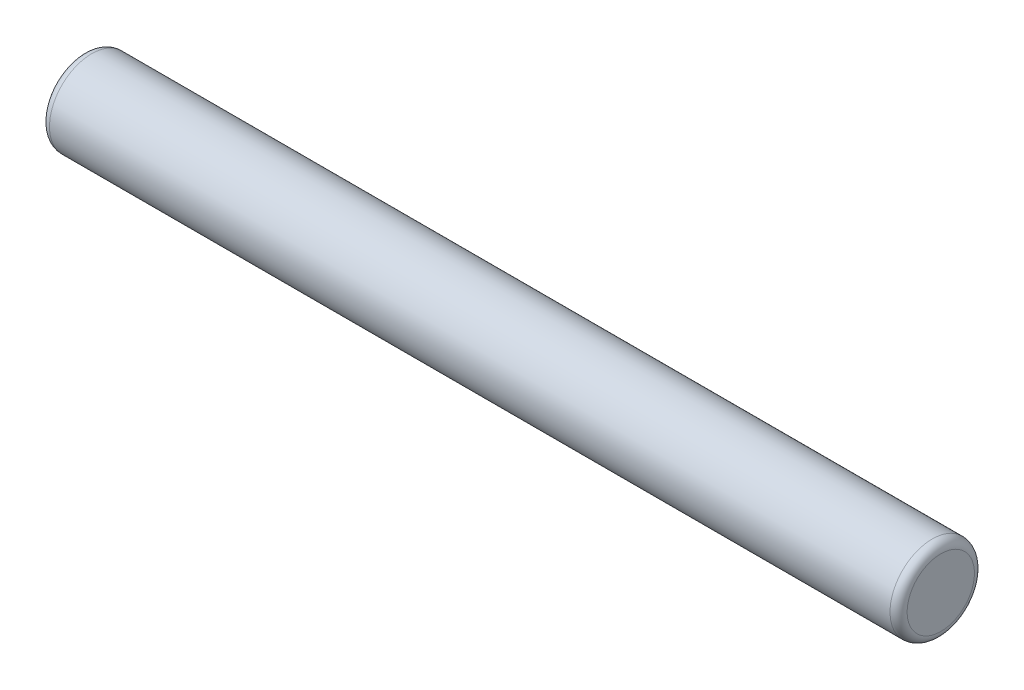
ISO-10303-21;
HEADER;
FILE_DESCRIPTION(('STEP AP214'),'2;1');
FILE_NAME('part.step','',(''),(''),'','','');
FILE_SCHEMA(('AUTOMOTIVE_DESIGN { 1 0 10303 214 1 1 1 1 }'));
ENDSEC;
DATA;
#1=APPLICATION_CONTEXT('core data for automotive mechanical design processes');
#2=APPLICATION_PROTOCOL_DEFINITION('international standard','automotive_design',2000,#1);
#3=PRODUCT_CONTEXT('',#1,'mechanical');
#4=PRODUCT('Part','Part','',(#3));
#5=PRODUCT_RELATED_PRODUCT_CATEGORY('part','',(#4));
#6=PRODUCT_DEFINITION_FORMATION('','',#4);
#7=PRODUCT_DEFINITION_CONTEXT('part definition',#1,'design');
#8=PRODUCT_DEFINITION('design','',#6,#7);
#9=PRODUCT_DEFINITION_SHAPE('','',#8);
#10=(LENGTH_UNIT() NAMED_UNIT(*) SI_UNIT(.MILLI.,.METRE.));
#11=(NAMED_UNIT(*) PLANE_ANGLE_UNIT() SI_UNIT($,.RADIAN.));
#12=(NAMED_UNIT(*) SI_UNIT($,.STERADIAN.) SOLID_ANGLE_UNIT());
#13=UNCERTAINTY_MEASURE_WITH_UNIT(LENGTH_MEASURE(1.E-05),#10,'distance_accuracy_value','');
#14=(GEOMETRIC_REPRESENTATION_CONTEXT(3) GLOBAL_UNCERTAINTY_ASSIGNED_CONTEXT((#13)) GLOBAL_UNIT_ASSIGNED_CONTEXT((#10,
#11,#12)) REPRESENTATION_CONTEXT('',''));
#15=CARTESIAN_POINT('',(0.,0.,0.));
#16=DIRECTION('',(0.,0.,1.));
#17=DIRECTION('',(1.,0.,0.));
#18=AXIS2_PLACEMENT_3D('',#15,#16,#17);
#19=CARTESIAN_POINT('',(50.8,0.,0.));
#20=DIRECTION('',(-1.,0.,0.));
#21=DIRECTION('',(0.,0.,1.));
#22=AXIS2_PLACEMENT_3D('',#19,#20,#21);
#23=CYLINDRICAL_SURFACE('',#22,2.5);
#24=CARTESIAN_POINT('',(50.292,0.,0.));
#25=DIRECTION('',(1.,0.,0.));
#26=DIRECTION('',(0.,0.,-1.));
#27=AXIS2_PLACEMENT_3D('',#24,#25,#26);
#28=CIRCLE('',#27,2.5);
#29=CARTESIAN_POINT('',(50.292,0.,-2.5));
#30=VERTEX_POINT('',#29);
#31=EDGE_CURVE('E46',#30,#30,#28,.F.);
#32=ORIENTED_EDGE('',*,*,#31,.T.);
#33=EDGE_LOOP('',(#32));
#34=FACE_BOUND('',#33,.T.);
#35=CARTESIAN_POINT('',(0.508000000000002,0.,0.));
#36=DIRECTION('',(1.,0.,0.));
#37=DIRECTION('',(0.,0.,-1.));
#38=AXIS2_PLACEMENT_3D('',#35,#36,#37);
#39=CIRCLE('',#38,2.5);
#40=CARTESIAN_POINT('',(0.508000000000002,0.,-2.5));
#41=VERTEX_POINT('',#40);
#42=EDGE_CURVE('E50',#41,#41,#39,.T.);
#43=ORIENTED_EDGE('',*,*,#42,.T.);
#44=EDGE_LOOP('',(#43));
#45=FACE_BOUND('',#44,.T.);
#46=ADVANCED_FACE('F39',(#34,#45),#23,.T.);
#47=CARTESIAN_POINT('',(50.8,0.,0.));
#48=DIRECTION('',(1.,0.,0.));
#49=DIRECTION('',(0.,0.,-1.));
#50=AXIS2_PLACEMENT_3D('',#47,#48,#49);
#51=PLANE('',#50);
#52=CARTESIAN_POINT('',(50.8,0.,0.));
#53=DIRECTION('',(1.,0.,0.));
#54=DIRECTION('',(0.,0.,-1.));
#55=AXIS2_PLACEMENT_3D('',#52,#53,#54);
#56=CIRCLE('',#55,1.992);
#57=CARTESIAN_POINT('',(50.8,0.,-1.992));
#58=VERTEX_POINT('',#57);
#59=EDGE_CURVE('E54',#58,#58,#56,.T.);
#60=ORIENTED_EDGE('',*,*,#59,.T.);
#61=EDGE_LOOP('',(#60));
#62=FACE_BOUND('',#61,.T.);
#63=ADVANCED_FACE('F60',(#62),#51,.T.);
#64=CARTESIAN_POINT('',(0.,0.,0.));
#65=DIRECTION('',(1.,0.,0.));
#66=DIRECTION('',(0.,0.,-1.));
#67=AXIS2_PLACEMENT_3D('',#64,#65,#66);
#68=PLANE('',#67);
#69=CARTESIAN_POINT('',(0.,0.,0.));
#70=DIRECTION('',(1.,0.,0.));
#71=DIRECTION('',(0.,0.,-1.));
#72=AXIS2_PLACEMENT_3D('',#69,#70,#71);
#73=CIRCLE('',#72,1.992);
#74=CARTESIAN_POINT('',(0.,0.,-1.992));
#75=VERTEX_POINT('',#74);
#76=EDGE_CURVE('E10',#75,#75,#73,.F.);
#77=ORIENTED_EDGE('',*,*,#76,.T.);
#78=EDGE_LOOP('',(#77));
#79=FACE_BOUND('',#78,.T.);
#80=ADVANCED_FACE('F64',(#79),#68,.F.);
#81=CARTESIAN_POINT('',(50.292,0.,0.));
#82=DIRECTION('',(1.,0.,0.));
#83=DIRECTION('',(0.,0.,-1.));
#84=AXIS2_PLACEMENT_3D('',#81,#82,#83);
#85=TOROIDAL_SURFACE('',#84,1.992,0.508);
#86=ORIENTED_EDGE('',*,*,#31,.F.);
#87=EDGE_LOOP('',(#86));
#88=FACE_BOUND('',#87,.T.);
#89=ORIENTED_EDGE('',*,*,#59,.F.);
#90=EDGE_LOOP('',(#89));
#91=FACE_BOUND('',#90,.T.);
#92=ADVANCED_FACE('F62',(#88,#91),#85,.T.);
#93=CARTESIAN_POINT('',(0.508000000000002,0.,0.));
#94=DIRECTION('',(1.,0.,0.));
#95=DIRECTION('',(0.,0.,-1.));
#96=AXIS2_PLACEMENT_3D('',#93,#94,#95);
#97=TOROIDAL_SURFACE('',#96,1.992,0.508);
#98=ORIENTED_EDGE('',*,*,#76,.F.);
#99=EDGE_LOOP('',(#98));
#100=FACE_BOUND('',#99,.T.);
#101=ORIENTED_EDGE('',*,*,#42,.F.);
#102=EDGE_LOOP('',(#101));
#103=FACE_BOUND('',#102,.T.);
#104=ADVANCED_FACE('F41',(#100,#103),#97,.T.);
#105=CLOSED_SHELL('',(#46,#63,#80,#92,#104));
#106=MANIFOLD_SOLID_BREP('B2',#105);
#107=ADVANCED_BREP_SHAPE_REPRESENTATION('',(#18,#106),#14);
#108=SHAPE_DEFINITION_REPRESENTATION(#9,#107);
ENDSEC;
END-ISO-10303-21;
